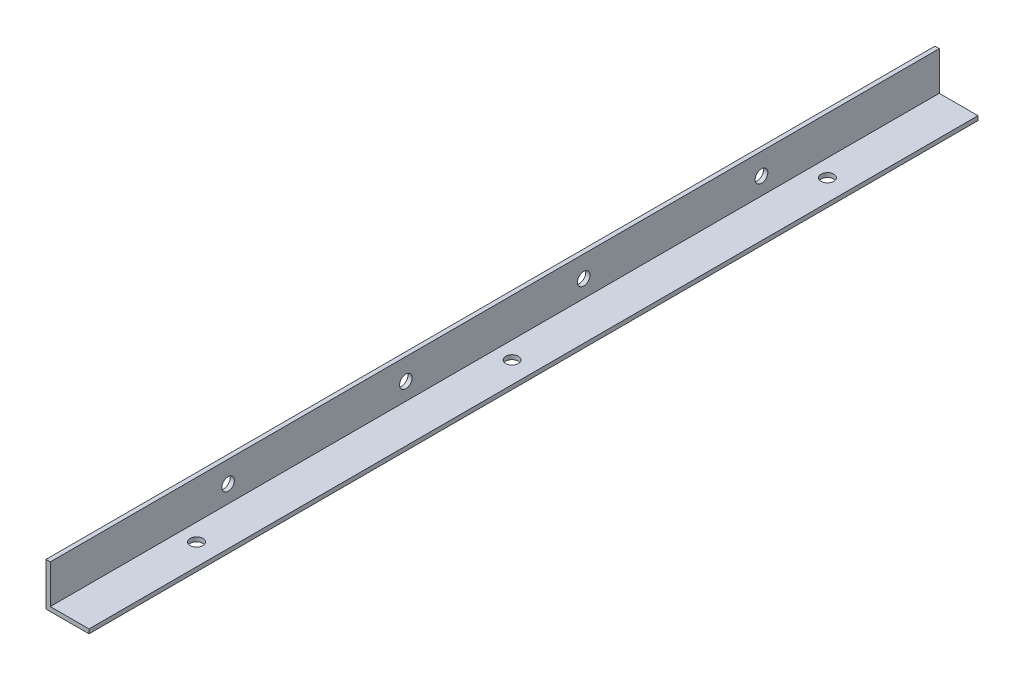
ISO-10303-21;
HEADER;
FILE_DESCRIPTION(('STEP AP214'),'2;1');
FILE_NAME('part.step','',(''),(''),'','','');
FILE_SCHEMA(('AUTOMOTIVE_DESIGN { 1 0 10303 214 1 1 1 1 }'));
ENDSEC;
DATA;
#1=APPLICATION_CONTEXT('core data for automotive mechanical design processes');
#2=APPLICATION_PROTOCOL_DEFINITION('international standard','automotive_design',2000,#1);
#3=PRODUCT_CONTEXT('',#1,'mechanical');
#4=PRODUCT('Part','Part','',(#3));
#5=PRODUCT_RELATED_PRODUCT_CATEGORY('part','',(#4));
#6=PRODUCT_DEFINITION_FORMATION('','',#4);
#7=PRODUCT_DEFINITION_CONTEXT('part definition',#1,'design');
#8=PRODUCT_DEFINITION('design','',#6,#7);
#9=PRODUCT_DEFINITION_SHAPE('','',#8);
#10=(LENGTH_UNIT() NAMED_UNIT(*) SI_UNIT(.MILLI.,.METRE.));
#11=(NAMED_UNIT(*) PLANE_ANGLE_UNIT() SI_UNIT($,.RADIAN.));
#12=(NAMED_UNIT(*) SI_UNIT($,.STERADIAN.) SOLID_ANGLE_UNIT());
#13=UNCERTAINTY_MEASURE_WITH_UNIT(LENGTH_MEASURE(1.E-05),#10,'distance_accuracy_value','');
#14=(GEOMETRIC_REPRESENTATION_CONTEXT(3) GLOBAL_UNCERTAINTY_ASSIGNED_CONTEXT((#13)) GLOBAL_UNIT_ASSIGNED_CONTEXT((#10,
#11,#12)) REPRESENTATION_CONTEXT('',''));
#15=CARTESIAN_POINT('',(0.,0.,0.));
#16=DIRECTION('',(0.,0.,1.));
#17=DIRECTION('',(1.,0.,0.));
#18=AXIS2_PLACEMENT_3D('',#15,#16,#17);
#19=CARTESIAN_POINT('',(1.5,0.,310.));
#20=DIRECTION('',(0.,-1.,0.));
#21=DIRECTION('',(0.,0.,-1.));
#22=AXIS2_PLACEMENT_3D('',#19,#20,#21);
#23=PLANE('',#22);
#24=DIRECTION('',(-1.,0.,0.));
#25=VECTOR('',#24,1.);
#26=CARTESIAN_POINT('',(1.5,0.,0.));
#27=LINE('',#26,#25);
#28=CARTESIAN_POINT('',(1.5,0.,0.));
#29=VERTEX_POINT('',#28);
#30=CARTESIAN_POINT('',(0.,0.,0.));
#31=VERTEX_POINT('',#30);
#32=EDGE_CURVE('E119',#29,#31,#27,.T.);
#33=ORIENTED_EDGE('',*,*,#32,.T.);
#34=DIRECTION('',(0.,0.,-1.));
#35=VECTOR('',#34,1.);
#36=CARTESIAN_POINT('',(0.,0.,310.));
#37=LINE('',#36,#35);
#38=CARTESIAN_POINT('',(0.,0.,310.));
#39=VERTEX_POINT('',#38);
#40=EDGE_CURVE('E11',#39,#31,#37,.T.);
#41=ORIENTED_EDGE('',*,*,#40,.F.);
#42=DIRECTION('',(-1.,0.,0.));
#43=VECTOR('',#42,1.);
#44=CARTESIAN_POINT('',(1.5,0.,310.));
#45=LINE('',#44,#43);
#46=CARTESIAN_POINT('',(1.5,0.,310.));
#47=VERTEX_POINT('',#46);
#48=EDGE_CURVE('E130',#47,#39,#45,.T.);
#49=ORIENTED_EDGE('',*,*,#48,.F.);
#50=DIRECTION('',(0.,0.,-1.));
#51=VECTOR('',#50,1.);
#52=CARTESIAN_POINT('',(1.5,0.,310.));
#53=LINE('',#52,#51);
#54=EDGE_CURVE('E115',#47,#29,#53,.T.);
#55=ORIENTED_EDGE('',*,*,#54,.T.);
#56=EDGE_LOOP('',(#33,#41,#49,#55));
#57=FACE_BOUND('',#56,.T.);
#58=ADVANCED_FACE('F33',(#57),#23,.F.);
#59=CARTESIAN_POINT('',(0.,0.,310.));
#60=DIRECTION('',(1.,0.,0.));
#61=DIRECTION('',(0.,1.,0.));
#62=AXIS2_PLACEMENT_3D('',#59,#60,#61);
#63=PLANE('',#62);
#64=CARTESIAN_POINT('',(0.,-7.50000000000004,62.));
#65=DIRECTION('',(-1.,0.,0.));
#66=DIRECTION('',(0.,-1.,0.));
#67=AXIS2_PLACEMENT_3D('',#64,#65,#66);
#68=CIRCLE('',#67,2.2);
#69=CARTESIAN_POINT('',(0.,-9.70000000000003,62.));
#70=VERTEX_POINT('',#69);
#71=EDGE_CURVE('E140',#70,#70,#68,.T.);
#72=ORIENTED_EDGE('',*,*,#71,.F.);
#73=EDGE_LOOP('',(#72));
#74=FACE_BOUND('',#73,.T.);
#75=CARTESIAN_POINT('',(0.,-7.50000000000003,124.));
#76=DIRECTION('',(-1.,0.,0.));
#77=DIRECTION('',(0.,-1.,0.));
#78=AXIS2_PLACEMENT_3D('',#75,#76,#77);
#79=CIRCLE('',#78,2.20000000000001);
#80=CARTESIAN_POINT('',(0.,-9.70000000000004,124.));
#81=VERTEX_POINT('',#80);
#82=EDGE_CURVE('E165',#81,#81,#79,.T.);
#83=ORIENTED_EDGE('',*,*,#82,.F.);
#84=EDGE_LOOP('',(#83));
#85=FACE_BOUND('',#84,.T.);
#86=CARTESIAN_POINT('',(0.,-7.50000000000002,186.));
#87=DIRECTION('',(-1.,0.,0.));
#88=DIRECTION('',(0.,-1.,0.));
#89=AXIS2_PLACEMENT_3D('',#86,#87,#88);
#90=CIRCLE('',#89,2.20000000000001);
#91=CARTESIAN_POINT('',(0.,-9.70000000000003,186.));
#92=VERTEX_POINT('',#91);
#93=EDGE_CURVE('E160',#92,#92,#90,.T.);
#94=ORIENTED_EDGE('',*,*,#93,.F.);
#95=EDGE_LOOP('',(#94));
#96=FACE_BOUND('',#95,.T.);
#97=CARTESIAN_POINT('',(0.,-7.50000000000001,248.));
#98=DIRECTION('',(-1.,0.,0.));
#99=DIRECTION('',(0.,-1.,0.));
#100=AXIS2_PLACEMENT_3D('',#97,#98,#99);
#101=CIRCLE('',#100,2.19999999999998);
#102=CARTESIAN_POINT('',(0.,-9.69999999999999,248.));
#103=VERTEX_POINT('',#102);
#104=EDGE_CURVE('E156',#103,#103,#101,.T.);
#105=ORIENTED_EDGE('',*,*,#104,.F.);
#106=EDGE_LOOP('',(#105));
#107=FACE_BOUND('',#106,.T.);
#108=DIRECTION('',(0.,-1.,0.));
#109=VECTOR('',#108,1.);
#110=CARTESIAN_POINT('',(0.,0.,0.));
#111=LINE('',#110,#109);
#112=CARTESIAN_POINT('',(0.,-15.,0.));
#113=VERTEX_POINT('',#112);
#114=EDGE_CURVE('E122',#31,#113,#111,.T.);
#115=ORIENTED_EDGE('',*,*,#114,.T.);
#116=DIRECTION('',(0.,0.,-1.));
#117=VECTOR('',#116,1.);
#118=CARTESIAN_POINT('',(0.,-15.,310.));
#119=LINE('',#118,#117);
#120=CARTESIAN_POINT('',(0.,-15.,310.));
#121=VERTEX_POINT('',#120);
#122=EDGE_CURVE('E42',#121,#113,#119,.T.);
#123=ORIENTED_EDGE('',*,*,#122,.F.);
#124=DIRECTION('',(0.,-1.,0.));
#125=VECTOR('',#124,1.);
#126=CARTESIAN_POINT('',(0.,0.,310.));
#127=LINE('',#126,#125);
#128=EDGE_CURVE('E88',#39,#121,#127,.T.);
#129=ORIENTED_EDGE('',*,*,#128,.F.);
#130=ORIENTED_EDGE('',*,*,#40,.T.);
#131=EDGE_LOOP('',(#115,#123,#129,#130));
#132=FACE_BOUND('',#131,.T.);
#133=ADVANCED_FACE('F172',(#74,#85,#96,#107,#132),#63,.F.);
#134=CARTESIAN_POINT('',(0.,-15.,310.));
#135=DIRECTION('',(0.,1.,0.));
#136=DIRECTION('',(0.,0.,1.));
#137=AXIS2_PLACEMENT_3D('',#134,#135,#136);
#138=PLANE('',#137);
#139=CARTESIAN_POINT('',(7.49999999999999,-15.,265.));
#140=DIRECTION('',(0.,-1.,0.));
#141=DIRECTION('',(0.,0.,-1.));
#142=AXIS2_PLACEMENT_3D('',#139,#140,#141);
#143=CIRCLE('',#142,2.19999999999999);
#144=CARTESIAN_POINT('',(7.49999999999999,-15.,262.8));
#145=VERTEX_POINT('',#144);
#146=EDGE_CURVE('E151',#145,#145,#143,.T.);
#147=ORIENTED_EDGE('',*,*,#146,.F.);
#148=EDGE_LOOP('',(#147));
#149=FACE_BOUND('',#148,.T.);
#150=CARTESIAN_POINT('',(7.5,-15.,155.));
#151=DIRECTION('',(0.,-1.,0.));
#152=DIRECTION('',(0.,0.,-1.));
#153=AXIS2_PLACEMENT_3D('',#150,#151,#152);
#154=CIRCLE('',#153,2.2);
#155=CARTESIAN_POINT('',(7.5,-15.,152.8));
#156=VERTEX_POINT('',#155);
#157=EDGE_CURVE('E339',#156,#156,#154,.T.);
#158=ORIENTED_EDGE('',*,*,#157,.F.);
#159=EDGE_LOOP('',(#158));
#160=FACE_BOUND('',#159,.T.);
#161=CARTESIAN_POINT('',(7.5,-15.,45.));
#162=DIRECTION('',(0.,-1.,0.));
#163=DIRECTION('',(0.,0.,-1.));
#164=AXIS2_PLACEMENT_3D('',#161,#162,#163);
#165=CIRCLE('',#164,2.2);
#166=CARTESIAN_POINT('',(7.5,-15.,42.8));
#167=VERTEX_POINT('',#166);
#168=EDGE_CURVE('E336',#167,#167,#165,.T.);
#169=ORIENTED_EDGE('',*,*,#168,.F.);
#170=EDGE_LOOP('',(#169));
#171=FACE_BOUND('',#170,.T.);
#172=DIRECTION('',(1.,0.,0.));
#173=VECTOR('',#172,1.);
#174=CARTESIAN_POINT('',(0.,-15.,0.));
#175=LINE('',#174,#173);
#176=CARTESIAN_POINT('',(15.,-15.,0.));
#177=VERTEX_POINT('',#176);
#178=EDGE_CURVE('E125',#113,#177,#175,.T.);
#179=ORIENTED_EDGE('',*,*,#178,.T.);
#180=DIRECTION('',(0.,0.,-1.));
#181=VECTOR('',#180,1.);
#182=CARTESIAN_POINT('',(15.,-15.,310.));
#183=LINE('',#182,#181);
#184=CARTESIAN_POINT('',(15.,-15.,310.));
#185=VERTEX_POINT('',#184);
#186=EDGE_CURVE('E110',#185,#177,#183,.T.);
#187=ORIENTED_EDGE('',*,*,#186,.F.);
#188=DIRECTION('',(1.,0.,0.));
#189=VECTOR('',#188,1.);
#190=CARTESIAN_POINT('',(0.,-15.,310.));
#191=LINE('',#190,#189);
#192=EDGE_CURVE('E101',#121,#185,#191,.T.);
#193=ORIENTED_EDGE('',*,*,#192,.F.);
#194=ORIENTED_EDGE('',*,*,#122,.T.);
#195=EDGE_LOOP('',(#179,#187,#193,#194));
#196=FACE_BOUND('',#195,.T.);
#197=ADVANCED_FACE('F175',(#149,#160,#171,#196),#138,.F.);
#198=CARTESIAN_POINT('',(15.,-15.,310.));
#199=DIRECTION('',(-1.,0.,0.));
#200=DIRECTION('',(0.,-1.,0.));
#201=AXIS2_PLACEMENT_3D('',#198,#199,#200);
#202=PLANE('',#201);
#203=DIRECTION('',(0.,1.,0.));
#204=VECTOR('',#203,1.);
#205=CARTESIAN_POINT('',(15.,-15.,0.));
#206=LINE('',#205,#204);
#207=CARTESIAN_POINT('',(15.,-13.5,0.));
#208=VERTEX_POINT('',#207);
#209=EDGE_CURVE('E109',#177,#208,#206,.T.);
#210=ORIENTED_EDGE('',*,*,#209,.T.);
#211=DIRECTION('',(0.,0.,-1.));
#212=VECTOR('',#211,1.);
#213=CARTESIAN_POINT('',(15.,-13.5,310.));
#214=LINE('',#213,#212);
#215=CARTESIAN_POINT('',(15.,-13.5,310.));
#216=VERTEX_POINT('',#215);
#217=EDGE_CURVE('E106',#216,#208,#214,.T.);
#218=ORIENTED_EDGE('',*,*,#217,.F.);
#219=DIRECTION('',(0.,1.,0.));
#220=VECTOR('',#219,1.);
#221=CARTESIAN_POINT('',(15.,-15.,310.));
#222=LINE('',#221,#220);
#223=EDGE_CURVE('E95',#185,#216,#222,.T.);
#224=ORIENTED_EDGE('',*,*,#223,.F.);
#225=ORIENTED_EDGE('',*,*,#186,.T.);
#226=EDGE_LOOP('',(#210,#218,#224,#225));
#227=FACE_BOUND('',#226,.T.);
#228=ADVANCED_FACE('F107',(#227),#202,.F.);
#229=CARTESIAN_POINT('',(15.,-13.5,310.));
#230=DIRECTION('',(0.,-1.,0.));
#231=DIRECTION('',(1.,0.,0.));
#232=AXIS2_PLACEMENT_3D('',#229,#230,#231);
#233=PLANE('',#232);
#234=CARTESIAN_POINT('',(7.49999999999999,-13.5,265.));
#235=DIRECTION('',(0.,-1.,0.));
#236=DIRECTION('',(1.,0.,0.));
#237=AXIS2_PLACEMENT_3D('',#234,#235,#236);
#238=CIRCLE('',#237,2.19999999999999);
#239=CARTESIAN_POINT('',(9.69999999999998,-13.5,265.));
#240=VERTEX_POINT('',#239);
#241=EDGE_CURVE('E36',#240,#240,#238,.T.);
#242=ORIENTED_EDGE('',*,*,#241,.T.);
#243=EDGE_LOOP('',(#242));
#244=FACE_BOUND('',#243,.T.);
#245=CARTESIAN_POINT('',(7.5,-13.5,155.));
#246=DIRECTION('',(0.,-1.,0.));
#247=DIRECTION('',(1.,0.,0.));
#248=AXIS2_PLACEMENT_3D('',#245,#246,#247);
#249=CIRCLE('',#248,2.2);
#250=CARTESIAN_POINT('',(9.7,-13.5,155.));
#251=VERTEX_POINT('',#250);
#252=EDGE_CURVE('E150',#251,#251,#249,.T.);
#253=ORIENTED_EDGE('',*,*,#252,.T.);
#254=EDGE_LOOP('',(#253));
#255=FACE_BOUND('',#254,.T.);
#256=CARTESIAN_POINT('',(7.5,-13.5,45.));
#257=DIRECTION('',(0.,-1.,0.));
#258=DIRECTION('',(1.,0.,0.));
#259=AXIS2_PLACEMENT_3D('',#256,#257,#258);
#260=CIRCLE('',#259,2.2);
#261=CARTESIAN_POINT('',(9.7,-13.5,45.));
#262=VERTEX_POINT('',#261);
#263=EDGE_CURVE('E148',#262,#262,#260,.T.);
#264=ORIENTED_EDGE('',*,*,#263,.T.);
#265=EDGE_LOOP('',(#264));
#266=FACE_BOUND('',#265,.T.);
#267=DIRECTION('',(-1.,0.,0.));
#268=VECTOR('',#267,1.);
#269=CARTESIAN_POINT('',(15.,-13.5,0.));
#270=LINE('',#269,#268);
#271=CARTESIAN_POINT('',(1.5,-13.5,0.));
#272=VERTEX_POINT('',#271);
#273=EDGE_CURVE('E74',#208,#272,#270,.T.);
#274=ORIENTED_EDGE('',*,*,#273,.T.);
#275=DIRECTION('',(0.,0.,-1.));
#276=VECTOR('',#275,1.);
#277=CARTESIAN_POINT('',(1.5,-13.5,310.));
#278=LINE('',#277,#276);
#279=CARTESIAN_POINT('',(1.5,-13.5,310.));
#280=VERTEX_POINT('',#279);
#281=EDGE_CURVE('E111',#280,#272,#278,.T.);
#282=ORIENTED_EDGE('',*,*,#281,.F.);
#283=DIRECTION('',(-1.,0.,0.));
#284=VECTOR('',#283,1.);
#285=CARTESIAN_POINT('',(15.,-13.5,310.));
#286=LINE('',#285,#284);
#287=EDGE_CURVE('E99',#216,#280,#286,.T.);
#288=ORIENTED_EDGE('',*,*,#287,.F.);
#289=ORIENTED_EDGE('',*,*,#217,.T.);
#290=EDGE_LOOP('',(#274,#282,#288,#289));
#291=FACE_BOUND('',#290,.T.);
#292=ADVANCED_FACE('F113',(#244,#255,#266,#291),#233,.F.);
#293=CARTESIAN_POINT('',(1.5,-13.5,310.));
#294=DIRECTION('',(-1.,0.,0.));
#295=DIRECTION('',(0.,-1.,0.));
#296=AXIS2_PLACEMENT_3D('',#293,#294,#295);
#297=PLANE('',#296);
#298=CARTESIAN_POINT('',(1.5,-7.50000000000004,62.));
#299=DIRECTION('',(-1.,0.,0.));
#300=DIRECTION('',(0.,-1.,0.));
#301=AXIS2_PLACEMENT_3D('',#298,#299,#300);
#302=CIRCLE('',#301,2.2);
#303=CARTESIAN_POINT('',(1.5,-9.70000000000003,62.));
#304=VERTEX_POINT('',#303);
#305=EDGE_CURVE('E123',#304,#304,#302,.T.);
#306=ORIENTED_EDGE('',*,*,#305,.T.);
#307=EDGE_LOOP('',(#306));
#308=FACE_BOUND('',#307,.T.);
#309=CARTESIAN_POINT('',(1.5,-7.50000000000003,124.));
#310=DIRECTION('',(-1.,0.,0.));
#311=DIRECTION('',(0.,-1.,0.));
#312=AXIS2_PLACEMENT_3D('',#309,#310,#311);
#313=CIRCLE('',#312,2.20000000000001);
#314=CARTESIAN_POINT('',(1.5,-9.70000000000004,124.));
#315=VERTEX_POINT('',#314);
#316=EDGE_CURVE('E143',#315,#315,#313,.T.);
#317=ORIENTED_EDGE('',*,*,#316,.T.);
#318=EDGE_LOOP('',(#317));
#319=FACE_BOUND('',#318,.T.);
#320=CARTESIAN_POINT('',(1.5,-7.50000000000002,186.));
#321=DIRECTION('',(-1.,0.,0.));
#322=DIRECTION('',(0.,-1.,0.));
#323=AXIS2_PLACEMENT_3D('',#320,#321,#322);
#324=CIRCLE('',#323,2.20000000000001);
#325=CARTESIAN_POINT('',(1.5,-9.70000000000003,186.));
#326=VERTEX_POINT('',#325);
#327=EDGE_CURVE('E139',#326,#326,#324,.T.);
#328=ORIENTED_EDGE('',*,*,#327,.T.);
#329=EDGE_LOOP('',(#328));
#330=FACE_BOUND('',#329,.T.);
#331=CARTESIAN_POINT('',(1.5,-7.50000000000001,248.));
#332=DIRECTION('',(-1.,0.,0.));
#333=DIRECTION('',(0.,-1.,0.));
#334=AXIS2_PLACEMENT_3D('',#331,#332,#333);
#335=CIRCLE('',#334,2.19999999999998);
#336=CARTESIAN_POINT('',(1.5,-9.69999999999999,248.));
#337=VERTEX_POINT('',#336);
#338=EDGE_CURVE('E136',#337,#337,#335,.T.);
#339=ORIENTED_EDGE('',*,*,#338,.T.);
#340=EDGE_LOOP('',(#339));
#341=FACE_BOUND('',#340,.T.);
#342=DIRECTION('',(0.,1.,0.));
#343=VECTOR('',#342,1.);
#344=CARTESIAN_POINT('',(1.5,-13.5,0.));
#345=LINE('',#344,#343);
#346=EDGE_CURVE('E80',#272,#29,#345,.T.);
#347=ORIENTED_EDGE('',*,*,#346,.T.);
#348=ORIENTED_EDGE('',*,*,#54,.F.);
#349=DIRECTION('',(0.,1.,0.));
#350=VECTOR('',#349,1.);
#351=CARTESIAN_POINT('',(1.5,-13.5,310.));
#352=LINE('',#351,#350);
#353=EDGE_CURVE('E51',#280,#47,#352,.T.);
#354=ORIENTED_EDGE('',*,*,#353,.F.);
#355=ORIENTED_EDGE('',*,*,#281,.T.);
#356=EDGE_LOOP('',(#347,#348,#354,#355));
#357=FACE_BOUND('',#356,.T.);
#358=ADVANCED_FACE('F180',(#308,#319,#330,#341,#357),#297,.F.);
#359=CARTESIAN_POINT('',(0.,0.,310.));
#360=DIRECTION('',(0.,0.,1.));
#361=DIRECTION('',(1.,0.,0.));
#362=AXIS2_PLACEMENT_3D('',#359,#360,#361);
#363=PLANE('',#362);
#364=ORIENTED_EDGE('',*,*,#48,.T.);
#365=ORIENTED_EDGE('',*,*,#128,.T.);
#366=ORIENTED_EDGE('',*,*,#192,.T.);
#367=ORIENTED_EDGE('',*,*,#223,.T.);
#368=ORIENTED_EDGE('',*,*,#287,.T.);
#369=ORIENTED_EDGE('',*,*,#353,.T.);
#370=EDGE_LOOP('',(#364,#365,#366,#367,#368,#369));
#371=FACE_BOUND('',#370,.T.);
#372=ADVANCED_FACE('F97',(#371),#363,.T.);
#373=CARTESIAN_POINT('',(0.,0.,0.));
#374=DIRECTION('',(0.,0.,1.));
#375=DIRECTION('',(1.,0.,0.));
#376=AXIS2_PLACEMENT_3D('',#373,#374,#375);
#377=PLANE('',#376);
#378=ORIENTED_EDGE('',*,*,#32,.F.);
#379=ORIENTED_EDGE('',*,*,#346,.F.);
#380=ORIENTED_EDGE('',*,*,#273,.F.);
#381=ORIENTED_EDGE('',*,*,#209,.F.);
#382=ORIENTED_EDGE('',*,*,#178,.F.);
#383=ORIENTED_EDGE('',*,*,#114,.F.);
#384=EDGE_LOOP('',(#378,#379,#380,#381,#382,#383));
#385=FACE_BOUND('',#384,.T.);
#386=ADVANCED_FACE('F178',(#385),#377,.F.);
#387=CARTESIAN_POINT('',(310.,-7.49999999999997,248.));
#388=DIRECTION('',(-1.,0.,0.));
#389=DIRECTION('',(0.,-1.,0.));
#390=AXIS2_PLACEMENT_3D('',#387,#388,#389);
#391=CYLINDRICAL_SURFACE('',#390,2.19999999999998);
#392=ORIENTED_EDGE('',*,*,#104,.T.);
#393=EDGE_LOOP('',(#392));
#394=FACE_BOUND('',#393,.T.);
#395=ORIENTED_EDGE('',*,*,#338,.F.);
#396=EDGE_LOOP('',(#395));
#397=FACE_BOUND('',#396,.T.);
#398=ADVANCED_FACE('F268',(#394,#397),#391,.F.);
#399=CARTESIAN_POINT('',(310.,-7.49999999999998,186.));
#400=DIRECTION('',(-1.,0.,0.));
#401=DIRECTION('',(0.,-1.,0.));
#402=AXIS2_PLACEMENT_3D('',#399,#400,#401);
#403=CYLINDRICAL_SURFACE('',#402,2.20000000000001);
#404=ORIENTED_EDGE('',*,*,#93,.T.);
#405=EDGE_LOOP('',(#404));
#406=FACE_BOUND('',#405,.T.);
#407=ORIENTED_EDGE('',*,*,#327,.F.);
#408=EDGE_LOOP('',(#407));
#409=FACE_BOUND('',#408,.T.);
#410=ADVANCED_FACE('F264',(#406,#409),#403,.F.);
#411=CARTESIAN_POINT('',(310.,-7.49999999999999,124.));
#412=DIRECTION('',(-1.,0.,0.));
#413=DIRECTION('',(0.,-1.,0.));
#414=AXIS2_PLACEMENT_3D('',#411,#412,#413);
#415=CYLINDRICAL_SURFACE('',#414,2.20000000000001);
#416=ORIENTED_EDGE('',*,*,#82,.T.);
#417=EDGE_LOOP('',(#416));
#418=FACE_BOUND('',#417,.T.);
#419=ORIENTED_EDGE('',*,*,#316,.F.);
#420=EDGE_LOOP('',(#419));
#421=FACE_BOUND('',#420,.T.);
#422=ADVANCED_FACE('F260',(#418,#421),#415,.F.);
#423=CARTESIAN_POINT('',(310.,-7.5,62.));
#424=DIRECTION('',(-1.,0.,0.));
#425=DIRECTION('',(0.,-1.,0.));
#426=AXIS2_PLACEMENT_3D('',#423,#424,#425);
#427=CYLINDRICAL_SURFACE('',#426,2.2);
#428=ORIENTED_EDGE('',*,*,#71,.T.);
#429=EDGE_LOOP('',(#428));
#430=FACE_BOUND('',#429,.T.);
#431=ORIENTED_EDGE('',*,*,#305,.F.);
#432=EDGE_LOOP('',(#431));
#433=FACE_BOUND('',#432,.T.);
#434=ADVANCED_FACE('F230',(#430,#433),#427,.F.);
#435=CARTESIAN_POINT('',(7.5,145.,45.));
#436=DIRECTION('',(0.,-1.,0.));
#437=DIRECTION('',(0.,0.,-1.));
#438=AXIS2_PLACEMENT_3D('',#435,#436,#437);
#439=CYLINDRICAL_SURFACE('',#438,2.2);
#440=ORIENTED_EDGE('',*,*,#168,.T.);
#441=EDGE_LOOP('',(#440));
#442=FACE_BOUND('',#441,.T.);
#443=ORIENTED_EDGE('',*,*,#263,.F.);
#444=EDGE_LOOP('',(#443));
#445=FACE_BOUND('',#444,.T.);
#446=ADVANCED_FACE('F224',(#442,#445),#439,.F.);
#447=CARTESIAN_POINT('',(7.5,145.,155.));
#448=DIRECTION('',(0.,-1.,0.));
#449=DIRECTION('',(0.,0.,-1.));
#450=AXIS2_PLACEMENT_3D('',#447,#448,#449);
#451=CYLINDRICAL_SURFACE('',#450,2.2);
#452=ORIENTED_EDGE('',*,*,#157,.T.);
#453=EDGE_LOOP('',(#452));
#454=FACE_BOUND('',#453,.T.);
#455=ORIENTED_EDGE('',*,*,#252,.F.);
#456=EDGE_LOOP('',(#455));
#457=FACE_BOUND('',#456,.T.);
#458=ADVANCED_FACE('F229',(#454,#457),#451,.F.);
#459=CARTESIAN_POINT('',(7.49999999999999,145.,265.));
#460=DIRECTION('',(0.,-1.,0.));
#461=DIRECTION('',(0.,0.,-1.));
#462=AXIS2_PLACEMENT_3D('',#459,#460,#461);
#463=CYLINDRICAL_SURFACE('',#462,2.19999999999999);
#464=ORIENTED_EDGE('',*,*,#146,.T.);
#465=EDGE_LOOP('',(#464));
#466=FACE_BOUND('',#465,.T.);
#467=ORIENTED_EDGE('',*,*,#241,.F.);
#468=EDGE_LOOP('',(#467));
#469=FACE_BOUND('',#468,.T.);
#470=ADVANCED_FACE('F242',(#466,#469),#463,.F.);
#471=CLOSED_SHELL('',(#58,#133,#197,#228,#292,#358,#372,#386,#398,#410,#422,#434,#446,#458,#470));
#472=MANIFOLD_SOLID_BREP('B2',#471);
#473=ADVANCED_BREP_SHAPE_REPRESENTATION('',(#18,#472),#14);
#474=SHAPE_DEFINITION_REPRESENTATION(#9,#473);
ENDSEC;
END-ISO-10303-21;
